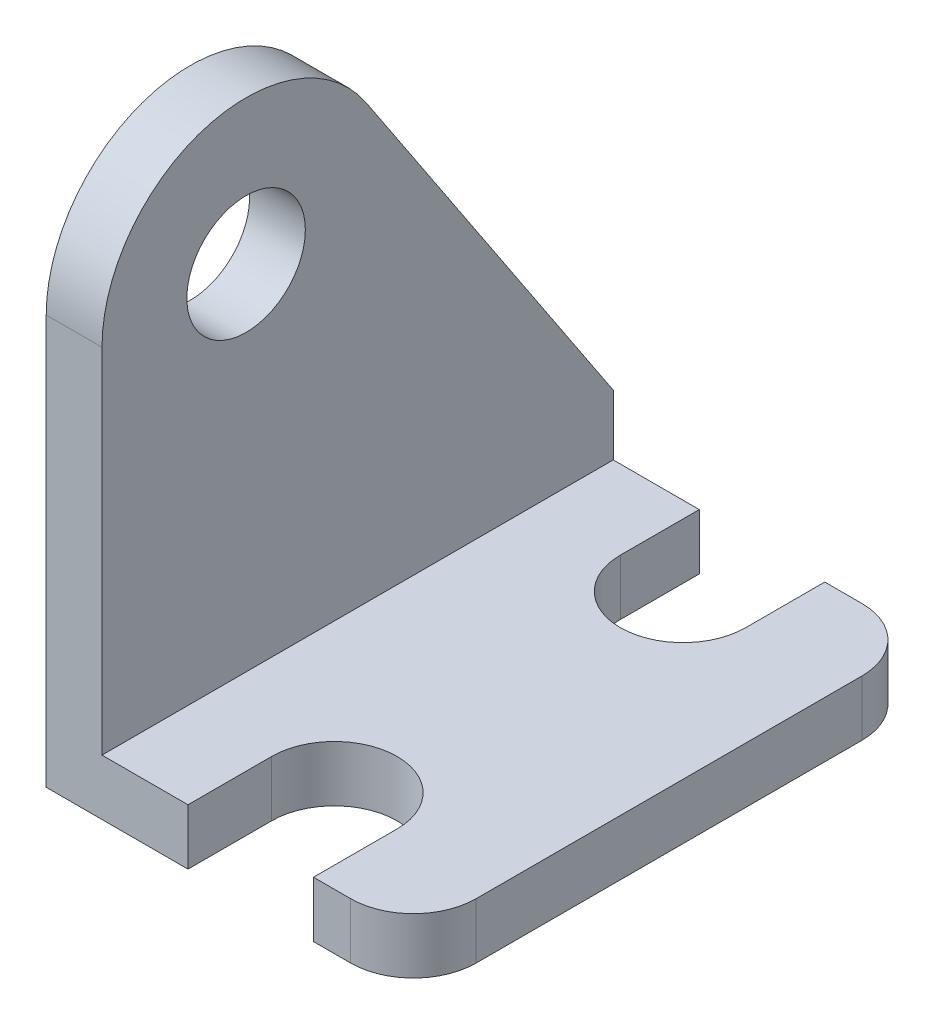
ISO-10303-21;
HEADER;
FILE_DESCRIPTION(('STEP AP214'),'2;1');
FILE_NAME('part.step','',(''),(''),'','','');
FILE_SCHEMA(('AUTOMOTIVE_DESIGN { 1 0 10303 214 1 1 1 1 }'));
ENDSEC;
DATA;
#1=APPLICATION_CONTEXT('core data for automotive mechanical design processes');
#2=APPLICATION_PROTOCOL_DEFINITION('international standard','automotive_design',2000,#1);
#3=PRODUCT_CONTEXT('',#1,'mechanical');
#4=PRODUCT('Part','Part','',(#3));
#5=PRODUCT_RELATED_PRODUCT_CATEGORY('part','',(#4));
#6=PRODUCT_DEFINITION_FORMATION('','',#4);
#7=PRODUCT_DEFINITION_CONTEXT('part definition',#1,'design');
#8=PRODUCT_DEFINITION('design','',#6,#7);
#9=PRODUCT_DEFINITION_SHAPE('','',#8);
#10=(LENGTH_UNIT() NAMED_UNIT(*) SI_UNIT(.MILLI.,.METRE.));
#11=(NAMED_UNIT(*) PLANE_ANGLE_UNIT() SI_UNIT($,.RADIAN.));
#12=(NAMED_UNIT(*) SI_UNIT($,.STERADIAN.) SOLID_ANGLE_UNIT());
#13=UNCERTAINTY_MEASURE_WITH_UNIT(LENGTH_MEASURE(1.E-05),#10,'distance_accuracy_value','');
#14=(GEOMETRIC_REPRESENTATION_CONTEXT(3) GLOBAL_UNCERTAINTY_ASSIGNED_CONTEXT((#13)) GLOBAL_UNIT_ASSIGNED_CONTEXT((#10,
#11,#12)) REPRESENTATION_CONTEXT('',''));
#15=CARTESIAN_POINT('',(0.,0.,0.));
#16=DIRECTION('',(0.,0.,1.));
#17=DIRECTION('',(1.,0.,0.));
#18=AXIS2_PLACEMENT_3D('',#15,#16,#17);
#19=CARTESIAN_POINT('',(0.,3.048,13.97));
#20=DIRECTION('',(1.,0.,0.));
#21=DIRECTION('',(0.,0.,-1.));
#22=AXIS2_PLACEMENT_3D('',#19,#20,#21);
#23=PLANE('',#22);
#24=DIRECTION('',(0.,0.,1.));
#25=VECTOR('',#24,1.);
#26=CARTESIAN_POINT('',(0.,0.,13.97));
#27=LINE('',#26,#25);
#28=CARTESIAN_POINT('',(0.,0.,-13.97));
#29=VERTEX_POINT('',#28);
#30=CARTESIAN_POINT('',(0.,0.,13.97));
#31=VERTEX_POINT('',#30);
#32=EDGE_CURVE('E190',#29,#31,#27,.T.);
#33=ORIENTED_EDGE('',*,*,#32,.T.);
#34=DIRECTION('',(0.,-1.,0.));
#35=VECTOR('',#34,1.);
#36=CARTESIAN_POINT('',(0.,3.048,13.97));
#37=LINE('',#36,#35);
#38=CARTESIAN_POINT('',(0.,22.352,13.97));
#39=VERTEX_POINT('',#38);
#40=EDGE_CURVE('E11',#39,#31,#37,.T.);
#41=ORIENTED_EDGE('',*,*,#40,.F.);
#42=CARTESIAN_POINT('',(0.,22.352,6.096));
#43=DIRECTION('',(-1.,0.,0.));
#44=DIRECTION('',(0.,0.,-1.));
#45=AXIS2_PLACEMENT_3D('',#42,#43,#44);
#46=CIRCLE('',#45,7.874);
#47=CARTESIAN_POINT('',(0.,26.7051158295357,-0.465269585579115));
#48=VERTEX_POINT('',#47);
#49=EDGE_CURVE('E166',#39,#48,#46,.T.);
#50=ORIENTED_EDGE('',*,*,#49,.T.);
#51=DIRECTION('',(0.,-0.833282903934356,-0.552846816044669));
#52=VECTOR('',#51,1.);
#53=CARTESIAN_POINT('',(0.,26.7051158295357,-0.465269585579112));
#54=LINE('',#53,#52);
#55=CARTESIAN_POINT('',(0.,6.35,-13.97));
#56=VERTEX_POINT('',#55);
#57=EDGE_CURVE('E160',#48,#56,#54,.T.);
#58=ORIENTED_EDGE('',*,*,#57,.T.);
#59=DIRECTION('',(0.,-1.,0.));
#60=VECTOR('',#59,1.);
#61=CARTESIAN_POINT('',(0.,3.048,-13.97));
#62=LINE('',#61,#60);
#63=EDGE_CURVE('E216',#56,#29,#62,.T.);
#64=ORIENTED_EDGE('',*,*,#63,.T.);
#65=EDGE_LOOP('',(#33,#41,#50,#58,#64));
#66=FACE_BOUND('',#65,.T.);
#67=CARTESIAN_POINT('',(0.,22.352,6.096));
#68=DIRECTION('',(-1.,0.,0.));
#69=DIRECTION('',(0.,0.,-1.));
#70=AXIS2_PLACEMENT_3D('',#67,#68,#69);
#71=CIRCLE('',#70,3.2385);
#72=CARTESIAN_POINT('',(0.,22.352,2.8575));
#73=VERTEX_POINT('',#72);
#74=EDGE_CURVE('E349',#73,#73,#71,.T.);
#75=ORIENTED_EDGE('',*,*,#74,.F.);
#76=EDGE_LOOP('',(#75));
#77=FACE_BOUND('',#76,.T.);
#78=ADVANCED_FACE('F34',(#66,#77),#23,.F.);
#79=CARTESIAN_POINT('',(0.,3.048,13.97));
#80=DIRECTION('',(0.,0.,-1.));
#81=DIRECTION('',(-1.,0.,0.));
#82=AXIS2_PLACEMENT_3D('',#79,#80,#81);
#83=PLANE('',#82);
#84=DIRECTION('',(1.,0.,0.));
#85=VECTOR('',#84,1.);
#86=CARTESIAN_POINT('',(0.,3.048,13.97));
#87=LINE('',#86,#85);
#88=CARTESIAN_POINT('',(3.048,3.048,13.97));
#89=VERTEX_POINT('',#88);
#90=CARTESIAN_POINT('',(7.747,3.048,13.97));
#91=VERTEX_POINT('',#90);
#92=EDGE_CURVE('E156',#89,#91,#87,.T.);
#93=ORIENTED_EDGE('',*,*,#92,.F.);
#94=DIRECTION('',(0.,1.,0.));
#95=VECTOR('',#94,1.);
#96=CARTESIAN_POINT('',(3.048,22.352,13.97));
#97=LINE('',#96,#95);
#98=CARTESIAN_POINT('',(3.048,22.352,13.97));
#99=VERTEX_POINT('',#98);
#100=EDGE_CURVE('E150',#89,#99,#97,.T.);
#101=ORIENTED_EDGE('',*,*,#100,.T.);
#102=DIRECTION('',(-1.,0.,0.));
#103=VECTOR('',#102,1.);
#104=CARTESIAN_POINT('',(3.048,22.352,13.97));
#105=LINE('',#104,#103);
#106=EDGE_CURVE('E153',#99,#39,#105,.T.);
#107=ORIENTED_EDGE('',*,*,#106,.T.);
#108=ORIENTED_EDGE('',*,*,#40,.T.);
#109=DIRECTION('',(1.,0.,0.));
#110=VECTOR('',#109,1.);
#111=CARTESIAN_POINT('',(0.,0.,13.97));
#112=LINE('',#111,#110);
#113=CARTESIAN_POINT('',(7.747,0.,13.97));
#114=VERTEX_POINT('',#113);
#115=EDGE_CURVE('E219',#31,#114,#112,.T.);
#116=ORIENTED_EDGE('',*,*,#115,.T.);
#117=DIRECTION('',(0.,-1.,0.));
#118=VECTOR('',#117,1.);
#119=CARTESIAN_POINT('',(7.747,3.048,13.97));
#120=LINE('',#119,#118);
#121=EDGE_CURVE('E41',#91,#114,#120,.T.);
#122=ORIENTED_EDGE('',*,*,#121,.F.);
#123=EDGE_LOOP('',(#93,#101,#107,#108,#116,#122));
#124=FACE_BOUND('',#123,.T.);
#125=ADVANCED_FACE('F152',(#124),#83,.F.);
#126=CARTESIAN_POINT('',(7.747,3.048,13.97));
#127=DIRECTION('',(-1.,0.,0.));
#128=DIRECTION('',(0.,0.,1.));
#129=AXIS2_PLACEMENT_3D('',#126,#127,#128);
#130=PLANE('',#129);
#131=DIRECTION('',(0.,0.,-1.));
#132=VECTOR('',#131,1.);
#133=CARTESIAN_POINT('',(7.747,0.,13.97));
#134=LINE('',#133,#132);
#135=CARTESIAN_POINT('',(7.74700000000001,0.,9.398));
#136=VERTEX_POINT('',#135);
#137=EDGE_CURVE('E221',#114,#136,#134,.T.);
#138=ORIENTED_EDGE('',*,*,#137,.T.);
#139=DIRECTION('',(0.,-1.,0.));
#140=VECTOR('',#139,1.);
#141=CARTESIAN_POINT('',(7.74700000000001,3.048,9.398));
#142=LINE('',#141,#140);
#143=CARTESIAN_POINT('',(7.74700000000001,3.048,9.398));
#144=VERTEX_POINT('',#143);
#145=EDGE_CURVE('E276',#144,#136,#142,.T.);
#146=ORIENTED_EDGE('',*,*,#145,.F.);
#147=DIRECTION('',(0.,0.,-1.));
#148=VECTOR('',#147,1.);
#149=CARTESIAN_POINT('',(7.747,3.048,13.97));
#150=LINE('',#149,#148);
#151=EDGE_CURVE('E192',#91,#144,#150,.T.);
#152=ORIENTED_EDGE('',*,*,#151,.F.);
#153=ORIENTED_EDGE('',*,*,#121,.T.);
#154=EDGE_LOOP('',(#138,#146,#152,#153));
#155=FACE_BOUND('',#154,.T.);
#156=ADVANCED_FACE('F282',(#155),#130,.F.);
#157=CARTESIAN_POINT('',(11.176,3.048,9.398));
#158=DIRECTION('',(0.,-1.,0.));
#159=DIRECTION('',(0.,0.,-1.));
#160=AXIS2_PLACEMENT_3D('',#157,#158,#159);
#161=CYLINDRICAL_SURFACE('',#160,3.429);
#162=CARTESIAN_POINT('',(11.176,0.,9.398));
#163=DIRECTION('',(0.,-1.,0.));
#164=DIRECTION('',(0.,0.,1.));
#165=AXIS2_PLACEMENT_3D('',#162,#163,#164);
#166=CIRCLE('',#165,3.429);
#167=CARTESIAN_POINT('',(14.605,0.,9.398));
#168=VERTEX_POINT('',#167);
#169=EDGE_CURVE('E223',#136,#168,#166,.T.);
#170=ORIENTED_EDGE('',*,*,#169,.T.);
#171=DIRECTION('',(0.,-1.,0.));
#172=VECTOR('',#171,1.);
#173=CARTESIAN_POINT('',(14.605,3.048,9.398));
#174=LINE('',#173,#172);
#175=CARTESIAN_POINT('',(14.605,3.048,9.398));
#176=VERTEX_POINT('',#175);
#177=EDGE_CURVE('E273',#176,#168,#174,.T.);
#178=ORIENTED_EDGE('',*,*,#177,.F.);
#179=CARTESIAN_POINT('',(11.176,3.048,9.398));
#180=DIRECTION('',(0.,-1.,0.));
#181=DIRECTION('',(0.,0.,1.));
#182=AXIS2_PLACEMENT_3D('',#179,#180,#181);
#183=CIRCLE('',#182,3.429);
#184=EDGE_CURVE('E195',#144,#176,#183,.T.);
#185=ORIENTED_EDGE('',*,*,#184,.F.);
#186=ORIENTED_EDGE('',*,*,#145,.T.);
#187=EDGE_LOOP('',(#170,#178,#185,#186));
#188=FACE_BOUND('',#187,.T.);
#189=ADVANCED_FACE('F292',(#188),#161,.F.);
#190=CARTESIAN_POINT('',(14.605,3.048,9.398));
#191=DIRECTION('',(1.,0.,0.));
#192=DIRECTION('',(0.,0.,-1.));
#193=AXIS2_PLACEMENT_3D('',#190,#191,#192);
#194=PLANE('',#193);
#195=DIRECTION('',(0.,0.,1.));
#196=VECTOR('',#195,1.);
#197=CARTESIAN_POINT('',(14.605,0.,9.398));
#198=LINE('',#197,#196);
#199=CARTESIAN_POINT('',(14.605,0.,13.97));
#200=VERTEX_POINT('',#199);
#201=EDGE_CURVE('E225',#168,#200,#198,.T.);
#202=ORIENTED_EDGE('',*,*,#201,.T.);
#203=DIRECTION('',(0.,-1.,0.));
#204=VECTOR('',#203,1.);
#205=CARTESIAN_POINT('',(14.605,3.048,13.97));
#206=LINE('',#205,#204);
#207=CARTESIAN_POINT('',(14.605,3.048,13.97));
#208=VERTEX_POINT('',#207);
#209=EDGE_CURVE('E270',#208,#200,#206,.T.);
#210=ORIENTED_EDGE('',*,*,#209,.F.);
#211=DIRECTION('',(0.,0.,1.));
#212=VECTOR('',#211,1.);
#213=CARTESIAN_POINT('',(14.605,3.048,9.398));
#214=LINE('',#213,#212);
#215=EDGE_CURVE('E197',#176,#208,#214,.T.);
#216=ORIENTED_EDGE('',*,*,#215,.F.);
#217=ORIENTED_EDGE('',*,*,#177,.T.);
#218=EDGE_LOOP('',(#202,#210,#216,#217));
#219=FACE_BOUND('',#218,.T.);
#220=ADVANCED_FACE('F296',(#219),#194,.F.);
#221=CARTESIAN_POINT('',(14.605,3.048,13.97));
#222=DIRECTION('',(0.,0.,-1.));
#223=DIRECTION('',(-1.,0.,0.));
#224=AXIS2_PLACEMENT_3D('',#221,#222,#223);
#225=PLANE('',#224);
#226=DIRECTION('',(1.,0.,0.));
#227=VECTOR('',#226,1.);
#228=CARTESIAN_POINT('',(14.605,0.,13.97));
#229=LINE('',#228,#227);
#230=CARTESIAN_POINT('',(16.637,0.,13.97));
#231=VERTEX_POINT('',#230);
#232=EDGE_CURVE('E227',#200,#231,#229,.T.);
#233=ORIENTED_EDGE('',*,*,#232,.T.);
#234=DIRECTION('',(0.,-1.,0.));
#235=VECTOR('',#234,1.);
#236=CARTESIAN_POINT('',(16.637,3.048,13.97));
#237=LINE('',#236,#235);
#238=CARTESIAN_POINT('',(16.637,3.048,13.97));
#239=VERTEX_POINT('',#238);
#240=EDGE_CURVE('E267',#239,#231,#237,.T.);
#241=ORIENTED_EDGE('',*,*,#240,.F.);
#242=DIRECTION('',(1.,0.,0.));
#243=VECTOR('',#242,1.);
#244=CARTESIAN_POINT('',(14.605,3.048,13.97));
#245=LINE('',#244,#243);
#246=EDGE_CURVE('E199',#208,#239,#245,.T.);
#247=ORIENTED_EDGE('',*,*,#246,.F.);
#248=ORIENTED_EDGE('',*,*,#209,.T.);
#249=EDGE_LOOP('',(#233,#241,#247,#248));
#250=FACE_BOUND('',#249,.T.);
#251=ADVANCED_FACE('F304',(#250),#225,.F.);
#252=CARTESIAN_POINT('',(16.637,3.048,10.541));
#253=DIRECTION('',(0.,-1.,0.));
#254=DIRECTION('',(0.,0.,-1.));
#255=AXIS2_PLACEMENT_3D('',#252,#253,#254);
#256=CYLINDRICAL_SURFACE('',#255,3.429);
#257=CARTESIAN_POINT('',(16.637,0.,10.541));
#258=DIRECTION('',(0.,1.,0.));
#259=DIRECTION('',(0.,0.,1.));
#260=AXIS2_PLACEMENT_3D('',#257,#258,#259);
#261=CIRCLE('',#260,3.429);
#262=CARTESIAN_POINT('',(20.066,0.,10.541));
#263=VERTEX_POINT('',#262);
#264=EDGE_CURVE('E229',#231,#263,#261,.T.);
#265=ORIENTED_EDGE('',*,*,#264,.T.);
#266=DIRECTION('',(0.,-1.,0.));
#267=VECTOR('',#266,1.);
#268=CARTESIAN_POINT('',(20.066,3.048,10.541));
#269=LINE('',#268,#267);
#270=CARTESIAN_POINT('',(20.066,3.048,10.541));
#271=VERTEX_POINT('',#270);
#272=EDGE_CURVE('E264',#271,#263,#269,.T.);
#273=ORIENTED_EDGE('',*,*,#272,.F.);
#274=CARTESIAN_POINT('',(16.637,3.048,10.541));
#275=DIRECTION('',(0.,1.,0.));
#276=DIRECTION('',(0.,0.,1.));
#277=AXIS2_PLACEMENT_3D('',#274,#275,#276);
#278=CIRCLE('',#277,3.429);
#279=EDGE_CURVE('E201',#239,#271,#278,.T.);
#280=ORIENTED_EDGE('',*,*,#279,.F.);
#281=ORIENTED_EDGE('',*,*,#240,.T.);
#282=EDGE_LOOP('',(#265,#273,#280,#281));
#283=FACE_BOUND('',#282,.T.);
#284=ADVANCED_FACE('F307',(#283),#256,.T.);
#285=CARTESIAN_POINT('',(20.066,3.048,-10.541));
#286=DIRECTION('',(-1.,0.,0.));
#287=DIRECTION('',(0.,0.,1.));
#288=AXIS2_PLACEMENT_3D('',#285,#286,#287);
#289=PLANE('',#288);
#290=DIRECTION('',(0.,0.,-1.));
#291=VECTOR('',#290,1.);
#292=CARTESIAN_POINT('',(20.066,0.,-10.541));
#293=LINE('',#292,#291);
#294=CARTESIAN_POINT('',(20.066,0.,-10.541));
#295=VERTEX_POINT('',#294);
#296=EDGE_CURVE('E231',#263,#295,#293,.T.);
#297=ORIENTED_EDGE('',*,*,#296,.T.);
#298=DIRECTION('',(0.,-1.,0.));
#299=VECTOR('',#298,1.);
#300=CARTESIAN_POINT('',(20.066,3.048,-10.541));
#301=LINE('',#300,#299);
#302=CARTESIAN_POINT('',(20.066,3.048,-10.541));
#303=VERTEX_POINT('',#302);
#304=EDGE_CURVE('E261',#303,#295,#301,.T.);
#305=ORIENTED_EDGE('',*,*,#304,.F.);
#306=DIRECTION('',(0.,0.,-1.));
#307=VECTOR('',#306,1.);
#308=CARTESIAN_POINT('',(20.066,3.048,-10.541));
#309=LINE('',#308,#307);
#310=EDGE_CURVE('E203',#271,#303,#309,.T.);
#311=ORIENTED_EDGE('',*,*,#310,.F.);
#312=ORIENTED_EDGE('',*,*,#272,.T.);
#313=EDGE_LOOP('',(#297,#305,#311,#312));
#314=FACE_BOUND('',#313,.T.);
#315=ADVANCED_FACE('F312',(#314),#289,.F.);
#316=CARTESIAN_POINT('',(16.637,3.048,-10.541));
#317=DIRECTION('',(0.,-1.,0.));
#318=DIRECTION('',(0.,0.,-1.));
#319=AXIS2_PLACEMENT_3D('',#316,#317,#318);
#320=CYLINDRICAL_SURFACE('',#319,3.429);
#321=CARTESIAN_POINT('',(16.637,0.,-10.541));
#322=DIRECTION('',(0.,1.,0.));
#323=DIRECTION('',(0.,0.,-1.));
#324=AXIS2_PLACEMENT_3D('',#321,#322,#323);
#325=CIRCLE('',#324,3.429);
#326=CARTESIAN_POINT('',(16.637,0.,-13.97));
#327=VERTEX_POINT('',#326);
#328=EDGE_CURVE('E233',#295,#327,#325,.T.);
#329=ORIENTED_EDGE('',*,*,#328,.T.);
#330=DIRECTION('',(0.,-1.,0.));
#331=VECTOR('',#330,1.);
#332=CARTESIAN_POINT('',(16.637,3.048,-13.97));
#333=LINE('',#332,#331);
#334=CARTESIAN_POINT('',(16.637,3.048,-13.97));
#335=VERTEX_POINT('',#334);
#336=EDGE_CURVE('E258',#335,#327,#333,.T.);
#337=ORIENTED_EDGE('',*,*,#336,.F.);
#338=CARTESIAN_POINT('',(16.637,3.048,-10.541));
#339=DIRECTION('',(0.,1.,0.));
#340=DIRECTION('',(0.,0.,-1.));
#341=AXIS2_PLACEMENT_3D('',#338,#339,#340);
#342=CIRCLE('',#341,3.429);
#343=EDGE_CURVE('E205',#303,#335,#342,.T.);
#344=ORIENTED_EDGE('',*,*,#343,.F.);
#345=ORIENTED_EDGE('',*,*,#304,.T.);
#346=EDGE_LOOP('',(#329,#337,#344,#345));
#347=FACE_BOUND('',#346,.T.);
#348=ADVANCED_FACE('F318',(#347),#320,.T.);
#349=CARTESIAN_POINT('',(14.605,3.048,-13.97));
#350=DIRECTION('',(0.,0.,1.));
#351=DIRECTION('',(1.,0.,0.));
#352=AXIS2_PLACEMENT_3D('',#349,#350,#351);
#353=PLANE('',#352);
#354=DIRECTION('',(-1.,0.,0.));
#355=VECTOR('',#354,1.);
#356=CARTESIAN_POINT('',(14.605,0.,-13.97));
#357=LINE('',#356,#355);
#358=CARTESIAN_POINT('',(14.605,0.,-13.97));
#359=VERTEX_POINT('',#358);
#360=EDGE_CURVE('E235',#327,#359,#357,.T.);
#361=ORIENTED_EDGE('',*,*,#360,.T.);
#362=DIRECTION('',(0.,-1.,0.));
#363=VECTOR('',#362,1.);
#364=CARTESIAN_POINT('',(14.605,3.048,-13.97));
#365=LINE('',#364,#363);
#366=CARTESIAN_POINT('',(14.605,3.048,-13.97));
#367=VERTEX_POINT('',#366);
#368=EDGE_CURVE('E255',#367,#359,#365,.T.);
#369=ORIENTED_EDGE('',*,*,#368,.F.);
#370=DIRECTION('',(-1.,0.,0.));
#371=VECTOR('',#370,1.);
#372=CARTESIAN_POINT('',(14.605,3.048,-13.97));
#373=LINE('',#372,#371);
#374=EDGE_CURVE('E207',#335,#367,#373,.T.);
#375=ORIENTED_EDGE('',*,*,#374,.F.);
#376=ORIENTED_EDGE('',*,*,#336,.T.);
#377=EDGE_LOOP('',(#361,#369,#375,#376));
#378=FACE_BOUND('',#377,.T.);
#379=ADVANCED_FACE('F322',(#378),#353,.F.);
#380=CARTESIAN_POINT('',(14.605,3.048,-9.652));
#381=DIRECTION('',(1.,0.,0.));
#382=DIRECTION('',(0.,0.,-1.));
#383=AXIS2_PLACEMENT_3D('',#380,#381,#382);
#384=PLANE('',#383);
#385=DIRECTION('',(0.,0.,1.));
#386=VECTOR('',#385,1.);
#387=CARTESIAN_POINT('',(14.605,0.,-9.652));
#388=LINE('',#387,#386);
#389=CARTESIAN_POINT('',(14.605,0.,-9.652));
#390=VERTEX_POINT('',#389);
#391=EDGE_CURVE('E237',#359,#390,#388,.T.);
#392=ORIENTED_EDGE('',*,*,#391,.T.);
#393=DIRECTION('',(0.,-1.,0.));
#394=VECTOR('',#393,1.);
#395=CARTESIAN_POINT('',(14.605,3.048,-9.652));
#396=LINE('',#395,#394);
#397=CARTESIAN_POINT('',(14.605,3.048,-9.652));
#398=VERTEX_POINT('',#397);
#399=EDGE_CURVE('E252',#398,#390,#396,.T.);
#400=ORIENTED_EDGE('',*,*,#399,.F.);
#401=DIRECTION('',(0.,0.,1.));
#402=VECTOR('',#401,1.);
#403=CARTESIAN_POINT('',(14.605,3.048,-9.652));
#404=LINE('',#403,#402);
#405=EDGE_CURVE('E209',#367,#398,#404,.T.);
#406=ORIENTED_EDGE('',*,*,#405,.F.);
#407=ORIENTED_EDGE('',*,*,#368,.T.);
#408=EDGE_LOOP('',(#392,#400,#406,#407));
#409=FACE_BOUND('',#408,.T.);
#410=ADVANCED_FACE('F327',(#409),#384,.F.);
#411=CARTESIAN_POINT('',(11.176,3.048,-9.652));
#412=DIRECTION('',(0.,-1.,0.));
#413=DIRECTION('',(0.,0.,-1.));
#414=AXIS2_PLACEMENT_3D('',#411,#412,#413);
#415=CYLINDRICAL_SURFACE('',#414,3.429);
#416=CARTESIAN_POINT('',(11.176,0.,-9.652));
#417=DIRECTION('',(0.,-1.,0.));
#418=DIRECTION('',(0.,0.,-1.));
#419=AXIS2_PLACEMENT_3D('',#416,#417,#418);
#420=CIRCLE('',#419,3.429);
#421=CARTESIAN_POINT('',(7.74700000000001,0.,-9.652));
#422=VERTEX_POINT('',#421);
#423=EDGE_CURVE('E239',#390,#422,#420,.T.);
#424=ORIENTED_EDGE('',*,*,#423,.T.);
#425=DIRECTION('',(0.,-1.,0.));
#426=VECTOR('',#425,1.);
#427=CARTESIAN_POINT('',(7.74700000000001,3.048,-9.652));
#428=LINE('',#427,#426);
#429=CARTESIAN_POINT('',(7.74700000000001,3.048,-9.652));
#430=VERTEX_POINT('',#429);
#431=EDGE_CURVE('E249',#430,#422,#428,.T.);
#432=ORIENTED_EDGE('',*,*,#431,.F.);
#433=CARTESIAN_POINT('',(11.176,3.048,-9.652));
#434=DIRECTION('',(0.,-1.,0.));
#435=DIRECTION('',(0.,0.,-1.));
#436=AXIS2_PLACEMENT_3D('',#433,#434,#435);
#437=CIRCLE('',#436,3.429);
#438=EDGE_CURVE('E211',#398,#430,#437,.T.);
#439=ORIENTED_EDGE('',*,*,#438,.F.);
#440=ORIENTED_EDGE('',*,*,#399,.T.);
#441=EDGE_LOOP('',(#424,#432,#439,#440));
#442=FACE_BOUND('',#441,.T.);
#443=ADVANCED_FACE('F333',(#442),#415,.F.);
#444=CARTESIAN_POINT('',(7.747,3.048,-13.97));
#445=DIRECTION('',(-1.,0.,0.));
#446=DIRECTION('',(0.,0.,1.));
#447=AXIS2_PLACEMENT_3D('',#444,#445,#446);
#448=PLANE('',#447);
#449=DIRECTION('',(0.,0.,-1.));
#450=VECTOR('',#449,1.);
#451=CARTESIAN_POINT('',(7.747,0.,-13.97));
#452=LINE('',#451,#450);
#453=CARTESIAN_POINT('',(7.747,0.,-13.97));
#454=VERTEX_POINT('',#453);
#455=EDGE_CURVE('E241',#422,#454,#452,.T.);
#456=ORIENTED_EDGE('',*,*,#455,.T.);
#457=DIRECTION('',(0.,-1.,0.));
#458=VECTOR('',#457,1.);
#459=CARTESIAN_POINT('',(7.747,3.048,-13.97));
#460=LINE('',#459,#458);
#461=CARTESIAN_POINT('',(7.747,3.048,-13.97));
#462=VERTEX_POINT('',#461);
#463=EDGE_CURVE('E246',#462,#454,#460,.T.);
#464=ORIENTED_EDGE('',*,*,#463,.F.);
#465=DIRECTION('',(0.,0.,-1.));
#466=VECTOR('',#465,1.);
#467=CARTESIAN_POINT('',(7.747,3.048,-13.97));
#468=LINE('',#467,#466);
#469=EDGE_CURVE('E213',#430,#462,#468,.T.);
#470=ORIENTED_EDGE('',*,*,#469,.F.);
#471=ORIENTED_EDGE('',*,*,#431,.T.);
#472=EDGE_LOOP('',(#456,#464,#470,#471));
#473=FACE_BOUND('',#472,.T.);
#474=ADVANCED_FACE('F337',(#473),#448,.F.);
#475=CARTESIAN_POINT('',(0.,3.048,-13.97));
#476=DIRECTION('',(0.,0.,1.));
#477=DIRECTION('',(1.,0.,0.));
#478=AXIS2_PLACEMENT_3D('',#475,#476,#477);
#479=PLANE('',#478);
#480=DIRECTION('',(-1.,0.,0.));
#481=VECTOR('',#480,1.);
#482=CARTESIAN_POINT('',(0.,0.,-13.97));
#483=LINE('',#482,#481);
#484=EDGE_CURVE('E193',#454,#29,#483,.T.);
#485=ORIENTED_EDGE('',*,*,#484,.T.);
#486=ORIENTED_EDGE('',*,*,#63,.F.);
#487=DIRECTION('',(-1.,0.,0.));
#488=VECTOR('',#487,1.);
#489=CARTESIAN_POINT('',(3.048,6.35,-13.97));
#490=LINE('',#489,#488);
#491=CARTESIAN_POINT('',(3.048,6.35,-13.97));
#492=VERTEX_POINT('',#491);
#493=EDGE_CURVE('E185',#492,#56,#490,.T.);
#494=ORIENTED_EDGE('',*,*,#493,.F.);
#495=DIRECTION('',(0.,-1.,0.));
#496=VECTOR('',#495,1.);
#497=CARTESIAN_POINT('',(3.048,0.,-13.97));
#498=LINE('',#497,#496);
#499=CARTESIAN_POINT('',(3.048,3.048,-13.97));
#500=VERTEX_POINT('',#499);
#501=EDGE_CURVE('E168',#492,#500,#498,.T.);
#502=ORIENTED_EDGE('',*,*,#501,.T.);
#503=DIRECTION('',(-1.,0.,0.));
#504=VECTOR('',#503,1.);
#505=CARTESIAN_POINT('',(0.,3.048,-13.97));
#506=LINE('',#505,#504);
#507=EDGE_CURVE('E48',#462,#500,#506,.T.);
#508=ORIENTED_EDGE('',*,*,#507,.F.);
#509=ORIENTED_EDGE('',*,*,#463,.T.);
#510=EDGE_LOOP('',(#485,#486,#494,#502,#508,#509));
#511=FACE_BOUND('',#510,.T.);
#512=ADVANCED_FACE('F340',(#511),#479,.F.);
#513=CARTESIAN_POINT('',(11.176,3.048,-9.652));
#514=DIRECTION('',(0.,-1.,0.));
#515=DIRECTION('',(0.,0.,-1.));
#516=AXIS2_PLACEMENT_3D('',#513,#514,#515);
#517=PLANE('',#516);
#518=ORIENTED_EDGE('',*,*,#507,.T.);
#519=DIRECTION('',(0.,0.,1.));
#520=VECTOR('',#519,1.);
#521=CARTESIAN_POINT('',(3.048,3.048,-9.652));
#522=LINE('',#521,#520);
#523=EDGE_CURVE('E52',#500,#89,#522,.T.);
#524=ORIENTED_EDGE('',*,*,#523,.T.);
#525=ORIENTED_EDGE('',*,*,#92,.T.);
#526=ORIENTED_EDGE('',*,*,#151,.T.);
#527=ORIENTED_EDGE('',*,*,#184,.T.);
#528=ORIENTED_EDGE('',*,*,#215,.T.);
#529=ORIENTED_EDGE('',*,*,#246,.T.);
#530=ORIENTED_EDGE('',*,*,#279,.T.);
#531=ORIENTED_EDGE('',*,*,#310,.T.);
#532=ORIENTED_EDGE('',*,*,#343,.T.);
#533=ORIENTED_EDGE('',*,*,#374,.T.);
#534=ORIENTED_EDGE('',*,*,#405,.T.);
#535=ORIENTED_EDGE('',*,*,#438,.T.);
#536=ORIENTED_EDGE('',*,*,#469,.T.);
#537=EDGE_LOOP('',(#518,#524,#525,#526,#527,#528,#529,#530,#531,#532,#533,#534,#535,#536));
#538=FACE_BOUND('',#537,.T.);
#539=ADVANCED_FACE('F299',(#538),#517,.F.);
#540=CARTESIAN_POINT('',(11.176,0.,-9.652));
#541=DIRECTION('',(0.,-1.,0.));
#542=DIRECTION('',(0.,0.,-1.));
#543=AXIS2_PLACEMENT_3D('',#540,#541,#542);
#544=PLANE('',#543);
#545=ORIENTED_EDGE('',*,*,#137,.F.);
#546=ORIENTED_EDGE('',*,*,#115,.F.);
#547=ORIENTED_EDGE('',*,*,#32,.F.);
#548=ORIENTED_EDGE('',*,*,#484,.F.);
#549=ORIENTED_EDGE('',*,*,#455,.F.);
#550=ORIENTED_EDGE('',*,*,#423,.F.);
#551=ORIENTED_EDGE('',*,*,#391,.F.);
#552=ORIENTED_EDGE('',*,*,#360,.F.);
#553=ORIENTED_EDGE('',*,*,#328,.F.);
#554=ORIENTED_EDGE('',*,*,#296,.F.);
#555=ORIENTED_EDGE('',*,*,#264,.F.);
#556=ORIENTED_EDGE('',*,*,#232,.F.);
#557=ORIENTED_EDGE('',*,*,#201,.F.);
#558=ORIENTED_EDGE('',*,*,#169,.F.);
#559=EDGE_LOOP('',(#545,#546,#547,#548,#549,#550,#551,#552,#553,#554,#555,#556,#557,#558));
#560=FACE_BOUND('',#559,.T.);
#561=ADVANCED_FACE('F286',(#560),#544,.T.);
#562=CARTESIAN_POINT('',(3.048,22.352,6.096));
#563=DIRECTION('',(1.,0.,0.));
#564=DIRECTION('',(0.,0.,-1.));
#565=AXIS2_PLACEMENT_3D('',#562,#563,#564);
#566=PLANE('',#565);
#567=CARTESIAN_POINT('',(3.048,22.352,6.096));
#568=DIRECTION('',(-1.,0.,0.));
#569=DIRECTION('',(0.,0.,-1.));
#570=AXIS2_PLACEMENT_3D('',#567,#568,#569);
#571=CIRCLE('',#570,3.2385);
#572=CARTESIAN_POINT('',(3.048,22.352,2.8575));
#573=VERTEX_POINT('',#572);
#574=EDGE_CURVE('E182',#573,#573,#571,.T.);
#575=ORIENTED_EDGE('',*,*,#574,.T.);
#576=EDGE_LOOP('',(#575));
#577=FACE_BOUND('',#576,.T.);
#578=ORIENTED_EDGE('',*,*,#523,.F.);
#579=ORIENTED_EDGE('',*,*,#501,.F.);
#580=DIRECTION('',(0.,-0.833282903934356,-0.552846816044669));
#581=VECTOR('',#580,1.);
#582=CARTESIAN_POINT('',(3.048,26.7051158295357,-0.465269585579112));
#583=LINE('',#582,#581);
#584=CARTESIAN_POINT('',(3.048,26.7051158295357,-0.465269585579115));
#585=VERTEX_POINT('',#584);
#586=EDGE_CURVE('E174',#585,#492,#583,.T.);
#587=ORIENTED_EDGE('',*,*,#586,.F.);
#588=CARTESIAN_POINT('',(3.048,22.352,6.096));
#589=DIRECTION('',(-1.,0.,0.));
#590=DIRECTION('',(0.,0.,-1.));
#591=AXIS2_PLACEMENT_3D('',#588,#589,#590);
#592=CIRCLE('',#591,7.874);
#593=EDGE_CURVE('E159',#99,#585,#592,.T.);
#594=ORIENTED_EDGE('',*,*,#593,.F.);
#595=ORIENTED_EDGE('',*,*,#100,.F.);
#596=EDGE_LOOP('',(#578,#579,#587,#594,#595));
#597=FACE_BOUND('',#596,.T.);
#598=ADVANCED_FACE('F171',(#577,#597),#566,.T.);
#599=CARTESIAN_POINT('',(3.048,26.7051158295357,-0.465269585579112));
#600=DIRECTION('',(0.,0.552846816044669,-0.833282903934356));
#601=DIRECTION('',(0.,0.833282903934356,0.552846816044669));
#602=AXIS2_PLACEMENT_3D('',#599,#600,#601);
#603=PLANE('',#602);
#604=ORIENTED_EDGE('',*,*,#57,.F.);
#605=DIRECTION('',(-1.,0.,0.));
#606=VECTOR('',#605,1.);
#607=CARTESIAN_POINT('',(3.048,26.7051158295357,-0.465269585579115));
#608=LINE('',#607,#606);
#609=EDGE_CURVE('E167',#585,#48,#608,.T.);
#610=ORIENTED_EDGE('',*,*,#609,.F.);
#611=ORIENTED_EDGE('',*,*,#586,.T.);
#612=ORIENTED_EDGE('',*,*,#493,.T.);
#613=EDGE_LOOP('',(#604,#610,#611,#612));
#614=FACE_BOUND('',#613,.T.);
#615=ADVANCED_FACE('F343',(#614),#603,.T.);
#616=CARTESIAN_POINT('',(3.048,22.352,6.096));
#617=DIRECTION('',(-1.,0.,0.));
#618=DIRECTION('',(0.,0.,1.));
#619=AXIS2_PLACEMENT_3D('',#616,#617,#618);
#620=CYLINDRICAL_SURFACE('',#619,7.874);
#621=ORIENTED_EDGE('',*,*,#49,.F.);
#622=ORIENTED_EDGE('',*,*,#106,.F.);
#623=ORIENTED_EDGE('',*,*,#593,.T.);
#624=ORIENTED_EDGE('',*,*,#609,.T.);
#625=EDGE_LOOP('',(#621,#622,#623,#624));
#626=FACE_BOUND('',#625,.T.);
#627=ADVANCED_FACE('F164',(#626),#620,.T.);
#628=CARTESIAN_POINT('',(3.048,22.352,6.096));
#629=DIRECTION('',(-1.,0.,0.));
#630=DIRECTION('',(0.,0.,1.));
#631=AXIS2_PLACEMENT_3D('',#628,#629,#630);
#632=CYLINDRICAL_SURFACE('',#631,3.2385);
#633=ORIENTED_EDGE('',*,*,#574,.F.);
#634=EDGE_LOOP('',(#633));
#635=FACE_BOUND('',#634,.T.);
#636=ORIENTED_EDGE('',*,*,#74,.T.);
#637=EDGE_LOOP('',(#636));
#638=FACE_BOUND('',#637,.T.);
#639=ADVANCED_FACE('F356',(#635,#638),#632,.F.);
#640=CLOSED_SHELL('',(#78,#125,#156,#189,#220,#251,#284,#315,#348,#379,#410,#443,#474,#512,#539,
#561,#598,#615,#627,#639));
#641=MANIFOLD_SOLID_BREP('B2',#640);
#642=ADVANCED_BREP_SHAPE_REPRESENTATION('',(#18,#641),#14);
#643=SHAPE_DEFINITION_REPRESENTATION(#9,#642);
ENDSEC;
END-ISO-10303-21;
